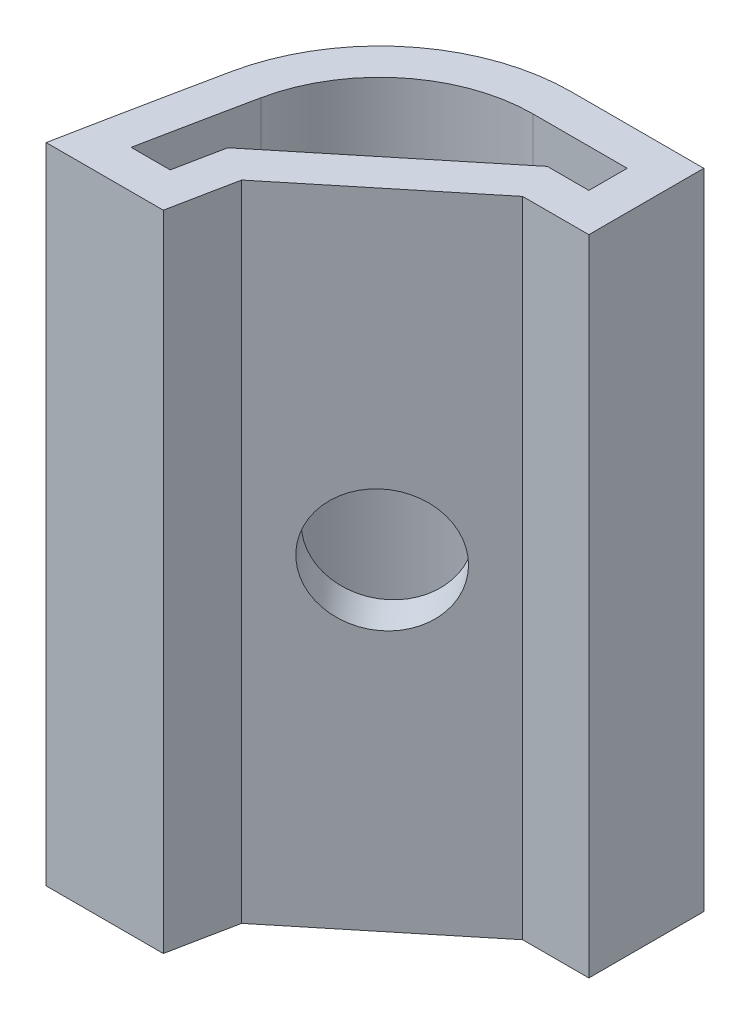
ISO-10303-21;
HEADER;
FILE_DESCRIPTION(('STEP AP214'),'2;1');
FILE_NAME('part.step','',(''),(''),'','','');
FILE_SCHEMA(('AUTOMOTIVE_DESIGN { 1 0 10303 214 1 1 1 1 }'));
ENDSEC;
DATA;
#1=APPLICATION_CONTEXT('core data for automotive mechanical design processes');
#2=APPLICATION_PROTOCOL_DEFINITION('international standard','automotive_design',2000,#1);
#3=PRODUCT_CONTEXT('',#1,'mechanical');
#4=PRODUCT('Part','Part','',(#3));
#5=PRODUCT_RELATED_PRODUCT_CATEGORY('part','',(#4));
#6=PRODUCT_DEFINITION_FORMATION('','',#4);
#7=PRODUCT_DEFINITION_CONTEXT('part definition',#1,'design');
#8=PRODUCT_DEFINITION('design','',#6,#7);
#9=PRODUCT_DEFINITION_SHAPE('','',#8);
#10=(LENGTH_UNIT() NAMED_UNIT(*) SI_UNIT(.MILLI.,.METRE.));
#11=(NAMED_UNIT(*) PLANE_ANGLE_UNIT() SI_UNIT($,.RADIAN.));
#12=(NAMED_UNIT(*) SI_UNIT($,.STERADIAN.) SOLID_ANGLE_UNIT());
#13=UNCERTAINTY_MEASURE_WITH_UNIT(LENGTH_MEASURE(1.E-05),#10,'distance_accuracy_value','');
#14=(GEOMETRIC_REPRESENTATION_CONTEXT(3) GLOBAL_UNCERTAINTY_ASSIGNED_CONTEXT((#13)) GLOBAL_UNIT_ASSIGNED_CONTEXT((#10,
#11,#12)) REPRESENTATION_CONTEXT('',''));
#15=CARTESIAN_POINT('',(0.,0.,0.));
#16=DIRECTION('',(0.,0.,1.));
#17=DIRECTION('',(1.,0.,0.));
#18=AXIS2_PLACEMENT_3D('',#15,#16,#17);
#19=CARTESIAN_POINT('',(330.675866357385,16.8,69.4730735392573));
#20=DIRECTION('',(0.,1.,0.));
#21=DIRECTION('',(0.,0.,1.));
#22=AXIS2_PLACEMENT_3D('',#19,#20,#21);
#23=PLANE('',#22);
#24=CARTESIAN_POINT('',(330.675866357385,16.8,69.4730735392573));
#25=DIRECTION('',(0.,-1.,0.));
#26=DIRECTION('',(0.,0.,1.));
#27=AXIS2_PLACEMENT_3D('',#24,#25,#26);
#28=CIRCLE('',#27,338.640625);
#29=CARTESIAN_POINT('',(-1.56986032753442,16.8,3.97307353925731));
#30=VERTEX_POINT('',#29);
#31=CARTESIAN_POINT('',(-1.22930994930909,16.8,2.26870730303372));
#32=VERTEX_POINT('',#31);
#33=EDGE_CURVE('E246',#30,#32,#28,.T.);
#34=ORIENTED_EDGE('',*,*,#33,.T.);
#35=DIRECTION('',(0.774572924816641,0.,-0.632484611781974));
#36=VECTOR('',#35,1.);
#37=CARTESIAN_POINT('',(-1.22930994930909,16.8,2.26870730303372));
#38=LINE('',#37,#36);
#39=CARTESIAN_POINT('',(2.80669130033509,16.8,-1.02692646074268));
#40=VERTEX_POINT('',#39);
#41=EDGE_CURVE('E250',#32,#40,#38,.T.);
#42=ORIENTED_EDGE('',*,*,#41,.T.);
#43=DIRECTION('',(1.,0.,0.));
#44=VECTOR('',#43,1.);
#45=CARTESIAN_POINT('',(2.80669130033509,16.8,-1.02692646074268));
#46=LINE('',#45,#44);
#47=CARTESIAN_POINT('',(4.5352413573857,16.8,-1.02692646074268));
#48=VERTEX_POINT('',#47);
#49=EDGE_CURVE('E254',#40,#48,#46,.T.);
#50=ORIENTED_EDGE('',*,*,#49,.T.);
#51=DIRECTION('',(0.,0.,-1.));
#52=VECTOR('',#51,1.);
#53=CARTESIAN_POINT('',(4.5352413573857,16.8,-1.02692646074268));
#54=LINE('',#53,#52);
#55=CARTESIAN_POINT('',(4.5352413573857,16.8,-4.02692646074268));
#56=VERTEX_POINT('',#55);
#57=EDGE_CURVE('E257',#48,#56,#54,.T.);
#58=ORIENTED_EDGE('',*,*,#57,.T.);
#59=DIRECTION('',(-1.,0.,0.));
#60=VECTOR('',#59,1.);
#61=CARTESIAN_POINT('',(4.5352413573857,16.8,-4.02692646074268));
#62=LINE('',#61,#60);
#63=CARTESIAN_POINT('',(1.07814124328448,16.8,-4.02692646074268));
#64=VERTEX_POINT('',#63);
#65=EDGE_CURVE('E260',#56,#64,#62,.T.);
#66=ORIENTED_EDGE('',*,*,#65,.T.);
#67=CARTESIAN_POINT('',(1.07814124328448,16.8,0.973073539257324));
#68=DIRECTION('',(0.,1.,0.));
#69=DIRECTION('',(0.,0.,1.));
#70=AXIS2_PLACEMENT_3D('',#67,#68,#69);
#71=CIRCLE('',#70,4.99999999999999);
#72=CARTESIAN_POINT('',(-3.81725314225796,16.8,-0.0443318912370688));
#73=VERTEX_POINT('',#72);
#74=EDGE_CURVE('E263',#64,#73,#71,.T.);
#75=ORIENTED_EDGE('',*,*,#74,.T.);
#76=CARTESIAN_POINT('',(330.675866357385,16.8,69.4730735392573));
#77=DIRECTION('',(0.,1.,0.));
#78=DIRECTION('',(0.,0.,1.));
#79=AXIS2_PLACEMENT_3D('',#76,#77,#78);
#80=CIRCLE('',#79,341.640625);
#81=CARTESIAN_POINT('',(-4.6270812144939,16.8,3.9730735392573));
#82=VERTEX_POINT('',#81);
#83=EDGE_CURVE('E266',#73,#82,#80,.T.);
#84=ORIENTED_EDGE('',*,*,#83,.T.);
#85=DIRECTION('',(1.,0.,0.));
#86=VECTOR('',#85,1.);
#87=CARTESIAN_POINT('',(-4.6270812144939,16.8,3.97307353925733));
#88=LINE('',#87,#86);
#89=EDGE_CURVE('E269',#82,#30,#88,.T.);
#90=ORIENTED_EDGE('',*,*,#89,.T.);
#91=EDGE_LOOP('',(#34,#42,#50,#58,#66,#75,#84,#90));
#92=FACE_BOUND('',#91,.T.);
#93=DIRECTION('',(0.774572924816645,0.,-0.632484611781969));
#94=VECTOR('',#93,1.);
#95=CARTESIAN_POINT('',(-2.13829037591695,16.8,1.71990956670673));
#96=LINE('',#95,#94);
#97=CARTESIAN_POINT('',(-2.13829037591695,16.8,1.71990956670673));
#98=VERTEX_POINT('',#97);
#99=CARTESIAN_POINT('',(2.4502761860634,16.8,-2.02692646074268));
#100=VERTEX_POINT('',#99);
#101=EDGE_CURVE('E164',#98,#100,#96,.T.);
#102=ORIENTED_EDGE('',*,*,#101,.F.);
#103=CARTESIAN_POINT('',(330.675866357385,16.8,69.4730735392573));
#104=DIRECTION('',(0.,-1.,0.));
#105=DIRECTION('',(0.,0.,1.));
#106=AXIS2_PLACEMENT_3D('',#103,#104,#105);
#107=CIRCLE('',#106,339.640625);
#108=CARTESIAN_POINT('',(-2.39094998790962,16.8,2.97307353925731));
#109=VERTEX_POINT('',#108);
#110=EDGE_CURVE('E155',#109,#98,#107,.T.);
#111=ORIENTED_EDGE('',*,*,#110,.F.);
#112=DIRECTION('',(1.,0.,0.));
#113=VECTOR('',#112,1.);
#114=CARTESIAN_POINT('',(-3.41062753362847,16.8,2.9730735392573));
#115=LINE('',#114,#113);
#116=CARTESIAN_POINT('',(-3.41062753362842,16.8,2.9730735392573));
#117=VERTEX_POINT('',#116);
#118=EDGE_CURVE('E197',#117,#109,#115,.T.);
#119=ORIENTED_EDGE('',*,*,#118,.F.);
#120=CARTESIAN_POINT('',(330.675866357385,16.8,69.4730735392573));
#121=DIRECTION('',(0.,1.,0.));
#122=DIRECTION('',(0.,0.,1.));
#123=AXIS2_PLACEMENT_3D('',#120,#121,#122);
#124=CIRCLE('',#123,340.640625);
#125=CARTESIAN_POINT('',(-2.83817426514948,16.8,0.159149194861805));
#126=VERTEX_POINT('',#125);
#127=EDGE_CURVE('E194',#126,#117,#124,.T.);
#128=ORIENTED_EDGE('',*,*,#127,.F.);
#129=CARTESIAN_POINT('',(1.07814124328448,16.8,0.973073539257324));
#130=DIRECTION('',(0.,1.,0.));
#131=DIRECTION('',(0.,0.,1.));
#132=AXIS2_PLACEMENT_3D('',#129,#130,#131);
#133=CIRCLE('',#132,4.);
#134=CARTESIAN_POINT('',(1.07814124328448,16.8,-3.02692646074267));
#135=VERTEX_POINT('',#134);
#136=EDGE_CURVE('E191',#135,#126,#133,.T.);
#137=ORIENTED_EDGE('',*,*,#136,.F.);
#138=DIRECTION('',(-1.,0.,0.));
#139=VECTOR('',#138,1.);
#140=CARTESIAN_POINT('',(3.5352413573857,16.8,-3.02692646074267));
#141=LINE('',#140,#139);
#142=CARTESIAN_POINT('',(3.5352413573857,16.8,-3.02692646074267));
#143=VERTEX_POINT('',#142);
#144=EDGE_CURVE('E188',#143,#135,#141,.T.);
#145=ORIENTED_EDGE('',*,*,#144,.F.);
#146=DIRECTION('',(0.,0.,-1.));
#147=VECTOR('',#146,1.);
#148=CARTESIAN_POINT('',(3.5352413573857,16.8,-2.02692646074268));
#149=LINE('',#148,#147);
#150=CARTESIAN_POINT('',(3.5352413573857,16.8,-2.02692646074268));
#151=VERTEX_POINT('',#150);
#152=EDGE_CURVE('E182',#151,#143,#149,.T.);
#153=ORIENTED_EDGE('',*,*,#152,.F.);
#154=DIRECTION('',(1.,0.,0.));
#155=VECTOR('',#154,1.);
#156=CARTESIAN_POINT('',(2.4502761860634,16.8,-2.02692646074268));
#157=LINE('',#156,#155);
#158=EDGE_CURVE('E178',#100,#151,#157,.T.);
#159=ORIENTED_EDGE('',*,*,#158,.F.);
#160=EDGE_LOOP('',(#102,#111,#119,#128,#137,#145,#153,#159));
#161=FACE_BOUND('',#160,.T.);
#162=ADVANCED_FACE('F41',(#92,#161),#23,.T.);
#163=CARTESIAN_POINT('',(330.675866357385,0.,69.4730735392573));
#164=DIRECTION('',(0.,1.,0.));
#165=DIRECTION('',(0.,0.,1.));
#166=AXIS2_PLACEMENT_3D('',#163,#164,#165);
#167=PLANE('',#166);
#168=CARTESIAN_POINT('',(330.675866357385,0.,69.4730735392573));
#169=DIRECTION('',(0.,-1.,0.));
#170=DIRECTION('',(0.,0.,1.));
#171=AXIS2_PLACEMENT_3D('',#168,#169,#170);
#172=CIRCLE('',#171,338.640625);
#173=CARTESIAN_POINT('',(-1.56986032753442,0.,3.97307353925731));
#174=VERTEX_POINT('',#173);
#175=CARTESIAN_POINT('',(-1.22930994930909,0.,2.26870730303372));
#176=VERTEX_POINT('',#175);
#177=EDGE_CURVE('E173',#174,#176,#172,.T.);
#178=ORIENTED_EDGE('',*,*,#177,.F.);
#179=DIRECTION('',(1.,0.,0.));
#180=VECTOR('',#179,1.);
#181=CARTESIAN_POINT('',(-4.6270812144939,0.,3.97307353925733));
#182=LINE('',#181,#180);
#183=CARTESIAN_POINT('',(-4.6270812144939,0.,3.9730735392573));
#184=VERTEX_POINT('',#183);
#185=EDGE_CURVE('E251',#184,#174,#182,.T.);
#186=ORIENTED_EDGE('',*,*,#185,.F.);
#187=CARTESIAN_POINT('',(330.675866357385,0.,69.4730735392573));
#188=DIRECTION('',(0.,1.,0.));
#189=DIRECTION('',(0.,0.,1.));
#190=AXIS2_PLACEMENT_3D('',#187,#188,#189);
#191=CIRCLE('',#190,341.640625);
#192=CARTESIAN_POINT('',(-3.81725314225796,0.,-0.0443318912370688));
#193=VERTEX_POINT('',#192);
#194=EDGE_CURVE('E291',#193,#184,#191,.T.);
#195=ORIENTED_EDGE('',*,*,#194,.F.);
#196=CARTESIAN_POINT('',(1.07814124328448,0.,0.973073539257324));
#197=DIRECTION('',(0.,1.,0.));
#198=DIRECTION('',(0.,0.,1.));
#199=AXIS2_PLACEMENT_3D('',#196,#197,#198);
#200=CIRCLE('',#199,4.99999999999999);
#201=CARTESIAN_POINT('',(1.07814124328448,0.,-4.02692646074268));
#202=VERTEX_POINT('',#201);
#203=EDGE_CURVE('E288',#202,#193,#200,.T.);
#204=ORIENTED_EDGE('',*,*,#203,.F.);
#205=DIRECTION('',(-1.,0.,0.));
#206=VECTOR('',#205,1.);
#207=CARTESIAN_POINT('',(4.5352413573857,0.,-4.02692646074268));
#208=LINE('',#207,#206);
#209=CARTESIAN_POINT('',(4.5352413573857,0.,-4.02692646074268));
#210=VERTEX_POINT('',#209);
#211=EDGE_CURVE('E285',#210,#202,#208,.T.);
#212=ORIENTED_EDGE('',*,*,#211,.F.);
#213=DIRECTION('',(0.,0.,-1.));
#214=VECTOR('',#213,1.);
#215=CARTESIAN_POINT('',(4.5352413573857,0.,-1.02692646074268));
#216=LINE('',#215,#214);
#217=CARTESIAN_POINT('',(4.5352413573857,0.,-1.02692646074268));
#218=VERTEX_POINT('',#217);
#219=EDGE_CURVE('E282',#218,#210,#216,.T.);
#220=ORIENTED_EDGE('',*,*,#219,.F.);
#221=DIRECTION('',(1.,0.,0.));
#222=VECTOR('',#221,1.);
#223=CARTESIAN_POINT('',(2.80669130033509,0.,-1.02692646074268));
#224=LINE('',#223,#222);
#225=CARTESIAN_POINT('',(2.80669130033509,0.,-1.02692646074268));
#226=VERTEX_POINT('',#225);
#227=EDGE_CURVE('E279',#226,#218,#224,.T.);
#228=ORIENTED_EDGE('',*,*,#227,.F.);
#229=DIRECTION('',(0.774572924816641,0.,-0.632484611781974));
#230=VECTOR('',#229,1.);
#231=CARTESIAN_POINT('',(-1.22930994930909,0.,2.26870730303372));
#232=LINE('',#231,#230);
#233=EDGE_CURVE('E276',#176,#226,#232,.T.);
#234=ORIENTED_EDGE('',*,*,#233,.F.);
#235=EDGE_LOOP('',(#178,#186,#195,#204,#212,#220,#228,#234));
#236=FACE_BOUND('',#235,.T.);
#237=CARTESIAN_POINT('',(330.675866357385,0.,69.4730735392573));
#238=DIRECTION('',(0.,-1.,0.));
#239=DIRECTION('',(0.,0.,1.));
#240=AXIS2_PLACEMENT_3D('',#237,#238,#239);
#241=CIRCLE('',#240,339.640625);
#242=CARTESIAN_POINT('',(-2.39094998790962,0.,2.97307353925732));
#243=VERTEX_POINT('',#242);
#244=CARTESIAN_POINT('',(-2.13829037591695,0.,1.71990956670673));
#245=VERTEX_POINT('',#244);
#246=EDGE_CURVE('E65',#243,#245,#241,.T.);
#247=ORIENTED_EDGE('',*,*,#246,.T.);
#248=DIRECTION('',(0.774572924816645,0.,-0.632484611781969));
#249=VECTOR('',#248,1.);
#250=CARTESIAN_POINT('',(-2.13829037591695,0.,1.71990956670673));
#251=LINE('',#250,#249);
#252=CARTESIAN_POINT('',(2.4502761860634,0.,-2.02692646074268));
#253=VERTEX_POINT('',#252);
#254=EDGE_CURVE('E171',#245,#253,#251,.T.);
#255=ORIENTED_EDGE('',*,*,#254,.T.);
#256=DIRECTION('',(1.,0.,0.));
#257=VECTOR('',#256,1.);
#258=CARTESIAN_POINT('',(2.4502761860634,0.,-2.02692646074268));
#259=LINE('',#258,#257);
#260=CARTESIAN_POINT('',(3.5352413573857,0.,-2.02692646074268));
#261=VERTEX_POINT('',#260);
#262=EDGE_CURVE('E205',#253,#261,#259,.T.);
#263=ORIENTED_EDGE('',*,*,#262,.T.);
#264=DIRECTION('',(0.,0.,-1.));
#265=VECTOR('',#264,1.);
#266=CARTESIAN_POINT('',(3.5352413573857,0.,-2.02692646074268));
#267=LINE('',#266,#265);
#268=CARTESIAN_POINT('',(3.5352413573857,0.,-3.02692646074267));
#269=VERTEX_POINT('',#268);
#270=EDGE_CURVE('E209',#261,#269,#267,.T.);
#271=ORIENTED_EDGE('',*,*,#270,.T.);
#272=DIRECTION('',(-1.,0.,0.));
#273=VECTOR('',#272,1.);
#274=CARTESIAN_POINT('',(3.5352413573857,0.,-3.02692646074267));
#275=LINE('',#274,#273);
#276=CARTESIAN_POINT('',(1.07814124328448,0.,-3.02692646074267));
#277=VERTEX_POINT('',#276);
#278=EDGE_CURVE('E213',#269,#277,#275,.T.);
#279=ORIENTED_EDGE('',*,*,#278,.T.);
#280=CARTESIAN_POINT('',(1.07814124328448,0.,0.973073539257324));
#281=DIRECTION('',(0.,1.,0.));
#282=DIRECTION('',(0.,0.,1.));
#283=AXIS2_PLACEMENT_3D('',#280,#281,#282);
#284=CIRCLE('',#283,4.);
#285=CARTESIAN_POINT('',(-2.83817426514948,0.,0.159149194861805));
#286=VERTEX_POINT('',#285);
#287=EDGE_CURVE('E217',#277,#286,#284,.T.);
#288=ORIENTED_EDGE('',*,*,#287,.T.);
#289=CARTESIAN_POINT('',(330.675866357385,0.,69.4730735392573));
#290=DIRECTION('',(0.,1.,0.));
#291=DIRECTION('',(0.,0.,1.));
#292=AXIS2_PLACEMENT_3D('',#289,#290,#291);
#293=CIRCLE('',#292,340.640625);
#294=CARTESIAN_POINT('',(-3.41062753362842,0.,2.97307353925719));
#295=VERTEX_POINT('',#294);
#296=EDGE_CURVE('E221',#286,#295,#293,.T.);
#297=ORIENTED_EDGE('',*,*,#296,.T.);
#298=DIRECTION('',(1.,0.,0.));
#299=VECTOR('',#298,1.);
#300=CARTESIAN_POINT('',(-3.41062753362847,0.,2.9730735392573));
#301=LINE('',#300,#299);
#302=EDGE_CURVE('E165',#295,#243,#301,.T.);
#303=ORIENTED_EDGE('',*,*,#302,.T.);
#304=EDGE_LOOP('',(#247,#255,#263,#271,#279,#288,#297,#303));
#305=FACE_BOUND('',#304,.T.);
#306=ADVANCED_FACE('F330',(#236,#305),#167,.F.);
#307=CARTESIAN_POINT('',(330.675866357385,16.8,69.4730735392573));
#308=DIRECTION('',(0.,-1.,0.));
#309=DIRECTION('',(0.,0.,-1.));
#310=AXIS2_PLACEMENT_3D('',#307,#308,#309);
#311=CYLINDRICAL_SURFACE('',#310,338.640625);
#312=ORIENTED_EDGE('',*,*,#177,.T.);
#313=DIRECTION('',(0.,-1.,0.));
#314=VECTOR('',#313,1.);
#315=CARTESIAN_POINT('',(-1.22930994930909,16.8,2.26870730303372));
#316=LINE('',#315,#314);
#317=EDGE_CURVE('E11',#32,#176,#316,.T.);
#318=ORIENTED_EDGE('',*,*,#317,.F.);
#319=ORIENTED_EDGE('',*,*,#33,.F.);
#320=DIRECTION('',(0.,-1.,0.));
#321=VECTOR('',#320,1.);
#322=CARTESIAN_POINT('',(-1.56986032753442,16.8,3.97307353925731));
#323=LINE('',#322,#321);
#324=EDGE_CURVE('E272',#30,#174,#323,.T.);
#325=ORIENTED_EDGE('',*,*,#324,.T.);
#326=EDGE_LOOP('',(#312,#318,#319,#325));
#327=FACE_BOUND('',#326,.T.);
#328=ADVANCED_FACE('F43',(#327),#311,.F.);
#329=CARTESIAN_POINT('',(-1.22930994930909,16.8,2.26870730303372));
#330=DIRECTION('',(-0.632484611781974,0.,-0.774572924816641));
#331=DIRECTION('',(-0.774572924816641,0.,0.632484611781974));
#332=AXIS2_PLACEMENT_3D('',#329,#330,#331);
#333=PLANE('',#332);
#334=CARTESIAN_POINT('',(0.788690675513001,8.4,0.620890421145521));
#335=DIRECTION('',(0.632484611781974,0.,0.774572924816641));
#336=DIRECTION('',(0.774572924816641,0.,-0.632484611781974));
#337=AXIS2_PLACEMENT_3D('',#334,#335,#336);
#338=CIRCLE('',#337,1.60222191709194);
#339=CARTESIAN_POINT('',(2.02972839204023,8.4,-0.392490286074941));
#340=VERTEX_POINT('',#339);
#341=EDGE_CURVE('E421',#340,#340,#338,.T.);
#342=ORIENTED_EDGE('',*,*,#341,.F.);
#343=EDGE_LOOP('',(#342));
#344=FACE_BOUND('',#343,.T.);
#345=ORIENTED_EDGE('',*,*,#233,.T.);
#346=DIRECTION('',(0.,-1.,0.));
#347=VECTOR('',#346,1.);
#348=CARTESIAN_POINT('',(2.80669130033509,16.8,-1.02692646074268));
#349=LINE('',#348,#347);
#350=EDGE_CURVE('E50',#40,#226,#349,.T.);
#351=ORIENTED_EDGE('',*,*,#350,.F.);
#352=ORIENTED_EDGE('',*,*,#41,.F.);
#353=ORIENTED_EDGE('',*,*,#317,.T.);
#354=EDGE_LOOP('',(#345,#351,#352,#353));
#355=FACE_BOUND('',#354,.T.);
#356=ADVANCED_FACE('F347',(#344,#355),#333,.F.);
#357=CARTESIAN_POINT('',(2.80669130033509,16.8,-1.02692646074268));
#358=DIRECTION('',(0.,0.,-1.));
#359=DIRECTION('',(-1.,0.,0.));
#360=AXIS2_PLACEMENT_3D('',#357,#358,#359);
#361=PLANE('',#360);
#362=ORIENTED_EDGE('',*,*,#227,.T.);
#363=DIRECTION('',(0.,-1.,0.));
#364=VECTOR('',#363,1.);
#365=CARTESIAN_POINT('',(4.5352413573857,16.8,-1.02692646074268));
#366=LINE('',#365,#364);
#367=EDGE_CURVE('E315',#48,#218,#366,.T.);
#368=ORIENTED_EDGE('',*,*,#367,.F.);
#369=ORIENTED_EDGE('',*,*,#49,.F.);
#370=ORIENTED_EDGE('',*,*,#350,.T.);
#371=EDGE_LOOP('',(#362,#368,#369,#370));
#372=FACE_BOUND('',#371,.T.);
#373=ADVANCED_FACE('F324',(#372),#361,.F.);
#374=CARTESIAN_POINT('',(4.5352413573857,16.8,-1.02692646074268));
#375=DIRECTION('',(-1.,0.,0.));
#376=DIRECTION('',(0.,0.,1.));
#377=AXIS2_PLACEMENT_3D('',#374,#375,#376);
#378=PLANE('',#377);
#379=ORIENTED_EDGE('',*,*,#219,.T.);
#380=DIRECTION('',(0.,-1.,0.));
#381=VECTOR('',#380,1.);
#382=CARTESIAN_POINT('',(4.5352413573857,16.8,-4.02692646074268));
#383=LINE('',#382,#381);
#384=EDGE_CURVE('E311',#56,#210,#383,.T.);
#385=ORIENTED_EDGE('',*,*,#384,.F.);
#386=ORIENTED_EDGE('',*,*,#57,.F.);
#387=ORIENTED_EDGE('',*,*,#367,.T.);
#388=EDGE_LOOP('',(#379,#385,#386,#387));
#389=FACE_BOUND('',#388,.T.);
#390=ADVANCED_FACE('F336',(#389),#378,.F.);
#391=CARTESIAN_POINT('',(4.5352413573857,16.8,-4.02692646074268));
#392=DIRECTION('',(0.,0.,1.));
#393=DIRECTION('',(1.,0.,0.));
#394=AXIS2_PLACEMENT_3D('',#391,#392,#393);
#395=PLANE('',#394);
#396=ORIENTED_EDGE('',*,*,#211,.T.);
#397=DIRECTION('',(0.,-1.,0.));
#398=VECTOR('',#397,1.);
#399=CARTESIAN_POINT('',(1.07814124328448,16.8,-4.02692646074268));
#400=LINE('',#399,#398);
#401=EDGE_CURVE('E307',#64,#202,#400,.T.);
#402=ORIENTED_EDGE('',*,*,#401,.F.);
#403=ORIENTED_EDGE('',*,*,#65,.F.);
#404=ORIENTED_EDGE('',*,*,#384,.T.);
#405=EDGE_LOOP('',(#396,#402,#403,#404));
#406=FACE_BOUND('',#405,.T.);
#407=ADVANCED_FACE('F340',(#406),#395,.F.);
#408=CARTESIAN_POINT('',(1.07814124328448,16.8,0.973073539257324));
#409=DIRECTION('',(0.,-1.,0.));
#410=DIRECTION('',(0.,0.,-1.));
#411=AXIS2_PLACEMENT_3D('',#408,#409,#410);
#412=CYLINDRICAL_SURFACE('',#411,4.99999999999999);
#413=ORIENTED_EDGE('',*,*,#203,.T.);
#414=DIRECTION('',(0.,-1.,0.));
#415=VECTOR('',#414,1.);
#416=CARTESIAN_POINT('',(-3.81725314225796,16.8,-0.0443318912370688));
#417=LINE('',#416,#415);
#418=EDGE_CURVE('E303',#73,#193,#417,.T.);
#419=ORIENTED_EDGE('',*,*,#418,.F.);
#420=ORIENTED_EDGE('',*,*,#74,.F.);
#421=ORIENTED_EDGE('',*,*,#401,.T.);
#422=EDGE_LOOP('',(#413,#419,#420,#421));
#423=FACE_BOUND('',#422,.T.);
#424=ADVANCED_FACE('F360',(#423),#412,.T.);
#425=CARTESIAN_POINT('',(330.675866357385,16.8,69.4730735392573));
#426=DIRECTION('',(0.,-1.,0.));
#427=DIRECTION('',(0.,0.,-1.));
#428=AXIS2_PLACEMENT_3D('',#425,#426,#427);
#429=CYLINDRICAL_SURFACE('',#428,341.640625);
#430=ORIENTED_EDGE('',*,*,#194,.T.);
#431=DIRECTION('',(0.,-1.,0.));
#432=VECTOR('',#431,1.);
#433=CARTESIAN_POINT('',(-4.6270812144939,16.8,3.9730735392573));
#434=LINE('',#433,#432);
#435=EDGE_CURVE('E299',#82,#184,#434,.T.);
#436=ORIENTED_EDGE('',*,*,#435,.F.);
#437=ORIENTED_EDGE('',*,*,#83,.F.);
#438=ORIENTED_EDGE('',*,*,#418,.T.);
#439=EDGE_LOOP('',(#430,#436,#437,#438));
#440=FACE_BOUND('',#439,.T.);
#441=ADVANCED_FACE('F358',(#440),#429,.T.);
#442=CARTESIAN_POINT('',(-4.6270812144939,16.8,3.97307353925733));
#443=DIRECTION('',(0.,0.,-1.));
#444=DIRECTION('',(-1.,0.,0.));
#445=AXIS2_PLACEMENT_3D('',#442,#443,#444);
#446=PLANE('',#445);
#447=ORIENTED_EDGE('',*,*,#185,.T.);
#448=ORIENTED_EDGE('',*,*,#324,.F.);
#449=ORIENTED_EDGE('',*,*,#89,.F.);
#450=ORIENTED_EDGE('',*,*,#435,.T.);
#451=EDGE_LOOP('',(#447,#448,#449,#450));
#452=FACE_BOUND('',#451,.T.);
#453=ADVANCED_FACE('F353',(#452),#446,.F.);
#454=CARTESIAN_POINT('',(330.675866357385,16.8,69.4730735392573));
#455=DIRECTION('',(0.,-1.,0.));
#456=DIRECTION('',(0.,0.,-1.));
#457=AXIS2_PLACEMENT_3D('',#454,#455,#456);
#458=CYLINDRICAL_SURFACE('',#457,339.640625);
#459=ORIENTED_EDGE('',*,*,#246,.F.);
#460=DIRECTION('',(0.,-1.,0.));
#461=VECTOR('',#460,1.);
#462=CARTESIAN_POINT('',(-2.39094998790962,16.8,2.97307353925731));
#463=LINE('',#462,#461);
#464=EDGE_CURVE('E159',#109,#243,#463,.T.);
#465=ORIENTED_EDGE('',*,*,#464,.F.);
#466=ORIENTED_EDGE('',*,*,#110,.T.);
#467=DIRECTION('',(0.,-1.,0.));
#468=VECTOR('',#467,1.);
#469=CARTESIAN_POINT('',(-2.13829037591695,16.8,1.71990956670673));
#470=LINE('',#469,#468);
#471=EDGE_CURVE('E158',#98,#245,#470,.T.);
#472=ORIENTED_EDGE('',*,*,#471,.T.);
#473=EDGE_LOOP('',(#459,#465,#466,#472));
#474=FACE_BOUND('',#473,.T.);
#475=ADVANCED_FACE('F157',(#474),#458,.T.);
#476=CARTESIAN_POINT('',(-2.13829037591695,16.8,1.71990956670673));
#477=DIRECTION('',(-0.632484611781969,0.,-0.774572924816645));
#478=DIRECTION('',(-0.774572924816645,0.,0.632484611781969));
#479=AXIS2_PLACEMENT_3D('',#476,#477,#478);
#480=PLANE('',#479);
#481=CARTESIAN_POINT('',(0.156206063731016,8.4,-0.153682503671133));
#482=DIRECTION('',(-0.632484611781969,0.,-0.774572924816645));
#483=DIRECTION('',(-0.774572924816645,0.,0.632484611781969));
#484=AXIS2_PLACEMENT_3D('',#481,#482,#483);
#485=CIRCLE('',#484,1.60222191709194);
#486=CARTESIAN_POINT('',(-1.08483165279622,8.4,0.859698203549321));
#487=VERTEX_POINT('',#486);
#488=EDGE_CURVE('E202',#487,#487,#485,.F.);
#489=ORIENTED_EDGE('',*,*,#488,.T.);
#490=EDGE_LOOP('',(#489));
#491=FACE_BOUND('',#490,.T.);
#492=ORIENTED_EDGE('',*,*,#254,.F.);
#493=ORIENTED_EDGE('',*,*,#471,.F.);
#494=ORIENTED_EDGE('',*,*,#101,.T.);
#495=DIRECTION('',(0.,-1.,0.));
#496=VECTOR('',#495,1.);
#497=CARTESIAN_POINT('',(2.4502761860634,16.8,-2.02692646074268));
#498=LINE('',#497,#496);
#499=EDGE_CURVE('E174',#100,#253,#498,.T.);
#500=ORIENTED_EDGE('',*,*,#499,.T.);
#501=EDGE_LOOP('',(#492,#493,#494,#500));
#502=FACE_BOUND('',#501,.T.);
#503=ADVANCED_FACE('F168',(#491,#502),#480,.T.);
#504=CARTESIAN_POINT('',(2.4502761860634,16.8,-2.02692646074268));
#505=DIRECTION('',(0.,0.,-1.));
#506=DIRECTION('',(-1.,0.,0.));
#507=AXIS2_PLACEMENT_3D('',#504,#505,#506);
#508=PLANE('',#507);
#509=ORIENTED_EDGE('',*,*,#262,.F.);
#510=ORIENTED_EDGE('',*,*,#499,.F.);
#511=ORIENTED_EDGE('',*,*,#158,.T.);
#512=DIRECTION('',(0.,-1.,0.));
#513=VECTOR('',#512,1.);
#514=CARTESIAN_POINT('',(3.5352413573857,16.8,-2.02692646074268));
#515=LINE('',#514,#513);
#516=EDGE_CURVE('E241',#151,#261,#515,.T.);
#517=ORIENTED_EDGE('',*,*,#516,.T.);
#518=EDGE_LOOP('',(#509,#510,#511,#517));
#519=FACE_BOUND('',#518,.T.);
#520=ADVANCED_FACE('F385',(#519),#508,.T.);
#521=CARTESIAN_POINT('',(3.5352413573857,16.8,-2.02692646074268));
#522=DIRECTION('',(-1.,0.,0.));
#523=DIRECTION('',(0.,0.,1.));
#524=AXIS2_PLACEMENT_3D('',#521,#522,#523);
#525=PLANE('',#524);
#526=ORIENTED_EDGE('',*,*,#270,.F.);
#527=ORIENTED_EDGE('',*,*,#516,.F.);
#528=ORIENTED_EDGE('',*,*,#152,.T.);
#529=DIRECTION('',(0.,-1.,0.));
#530=VECTOR('',#529,1.);
#531=CARTESIAN_POINT('',(3.5352413573857,16.8,-3.02692646074267));
#532=LINE('',#531,#530);
#533=EDGE_CURVE('E238',#143,#269,#532,.T.);
#534=ORIENTED_EDGE('',*,*,#533,.T.);
#535=EDGE_LOOP('',(#526,#527,#528,#534));
#536=FACE_BOUND('',#535,.T.);
#537=ADVANCED_FACE('F390',(#536),#525,.T.);
#538=CARTESIAN_POINT('',(3.5352413573857,16.8,-3.02692646074267));
#539=DIRECTION('',(0.,0.,1.));
#540=DIRECTION('',(1.,0.,0.));
#541=AXIS2_PLACEMENT_3D('',#538,#539,#540);
#542=PLANE('',#541);
#543=ORIENTED_EDGE('',*,*,#278,.F.);
#544=ORIENTED_EDGE('',*,*,#533,.F.);
#545=ORIENTED_EDGE('',*,*,#144,.T.);
#546=DIRECTION('',(0.,-1.,0.));
#547=VECTOR('',#546,1.);
#548=CARTESIAN_POINT('',(1.07814124328448,16.8,-3.02692646074267));
#549=LINE('',#548,#547);
#550=EDGE_CURVE('E235',#135,#277,#549,.T.);
#551=ORIENTED_EDGE('',*,*,#550,.T.);
#552=EDGE_LOOP('',(#543,#544,#545,#551));
#553=FACE_BOUND('',#552,.T.);
#554=ADVANCED_FACE('F397',(#553),#542,.T.);
#555=CARTESIAN_POINT('',(1.07814124328448,16.8,0.973073539257324));
#556=DIRECTION('',(0.,-1.,0.));
#557=DIRECTION('',(0.,0.,-1.));
#558=AXIS2_PLACEMENT_3D('',#555,#556,#557);
#559=CYLINDRICAL_SURFACE('',#558,4.);
#560=ORIENTED_EDGE('',*,*,#287,.F.);
#561=ORIENTED_EDGE('',*,*,#550,.F.);
#562=ORIENTED_EDGE('',*,*,#136,.T.);
#563=DIRECTION('',(0.,-1.,0.));
#564=VECTOR('',#563,1.);
#565=CARTESIAN_POINT('',(-2.83817426514948,16.8,0.159149194861805));
#566=LINE('',#565,#564);
#567=EDGE_CURVE('E232',#126,#286,#566,.T.);
#568=ORIENTED_EDGE('',*,*,#567,.T.);
#569=EDGE_LOOP('',(#560,#561,#562,#568));
#570=FACE_BOUND('',#569,.T.);
#571=ADVANCED_FACE('F401',(#570),#559,.F.);
#572=CARTESIAN_POINT('',(330.675866357385,16.8,69.4730735392573));
#573=DIRECTION('',(0.,-1.,0.));
#574=DIRECTION('',(0.,0.,-1.));
#575=AXIS2_PLACEMENT_3D('',#572,#573,#574);
#576=CYLINDRICAL_SURFACE('',#575,340.640625);
#577=ORIENTED_EDGE('',*,*,#296,.F.);
#578=ORIENTED_EDGE('',*,*,#567,.F.);
#579=ORIENTED_EDGE('',*,*,#127,.T.);
#580=DIRECTION('',(0.,-1.,0.));
#581=VECTOR('',#580,1.);
#582=CARTESIAN_POINT('',(-3.41062753362842,16.8,2.97307353925719));
#583=LINE('',#582,#581);
#584=EDGE_CURVE('E57',#117,#295,#583,.T.);
#585=ORIENTED_EDGE('',*,*,#584,.T.);
#586=EDGE_LOOP('',(#577,#578,#579,#585));
#587=FACE_BOUND('',#586,.T.);
#588=ADVANCED_FACE('F405',(#587),#576,.F.);
#589=CARTESIAN_POINT('',(-3.41062753362847,16.8,2.9730735392573));
#590=DIRECTION('',(0.,0.,-1.));
#591=DIRECTION('',(-1.,0.,0.));
#592=AXIS2_PLACEMENT_3D('',#589,#590,#591);
#593=PLANE('',#592);
#594=ORIENTED_EDGE('',*,*,#302,.F.);
#595=ORIENTED_EDGE('',*,*,#584,.F.);
#596=ORIENTED_EDGE('',*,*,#118,.T.);
#597=ORIENTED_EDGE('',*,*,#464,.T.);
#598=EDGE_LOOP('',(#594,#595,#596,#597));
#599=FACE_BOUND('',#598,.T.);
#600=ADVANCED_FACE('F409',(#599),#593,.T.);
#601=CARTESIAN_POINT('',(-2.71006741626582,8.4,-3.66386724392982));
#602=DIRECTION('',(0.632484611781974,0.,0.774572924816641));
#603=DIRECTION('',(0.774572924816641,0.,-0.632484611781974));
#604=AXIS2_PLACEMENT_3D('',#601,#602,#603);
#605=CYLINDRICAL_SURFACE('',#604,1.60222191709194);
#606=ORIENTED_EDGE('',*,*,#341,.T.);
#607=EDGE_LOOP('',(#606));
#608=FACE_BOUND('',#607,.T.);
#609=ORIENTED_EDGE('',*,*,#488,.F.);
#610=EDGE_LOOP('',(#609));
#611=FACE_BOUND('',#610,.T.);
#612=ADVANCED_FACE('F413',(#608,#611),#605,.F.);
#613=CLOSED_SHELL('',(#162,#306,#328,#356,#373,#390,#407,#424,#441,#453,#475,#503,#520,#537,
#554,#571,#588,#600,#612));
#614=MANIFOLD_SOLID_BREP('B2',#613);
#615=ADVANCED_BREP_SHAPE_REPRESENTATION('',(#18,#614),#14);
#616=SHAPE_DEFINITION_REPRESENTATION(#9,#615);
ENDSEC;
END-ISO-10303-21;
